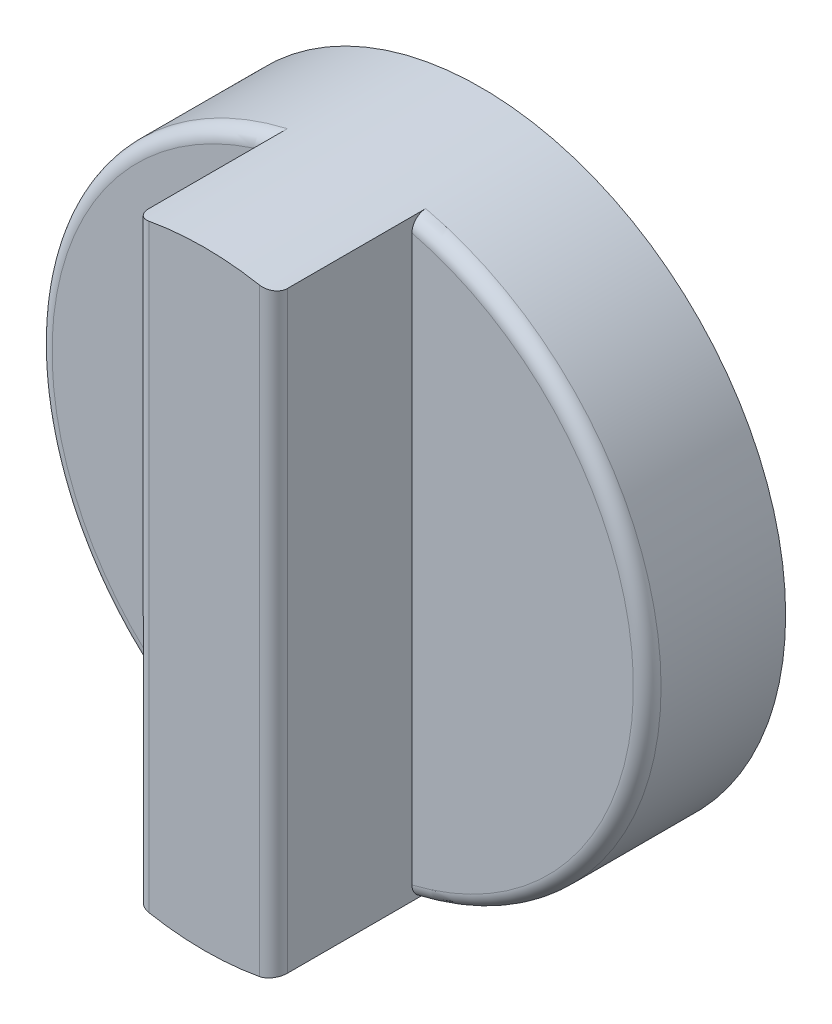
ISO-10303-21;
HEADER;
FILE_DESCRIPTION(('STEP AP214'),'2;1');
FILE_NAME('part.step','',(''),(''),'','','');
FILE_SCHEMA(('AUTOMOTIVE_DESIGN { 1 0 10303 214 1 1 1 1 }'));
ENDSEC;
DATA;
#1=APPLICATION_CONTEXT('core data for automotive mechanical design processes');
#2=APPLICATION_PROTOCOL_DEFINITION('international standard','automotive_design',2000,#1);
#3=PRODUCT_CONTEXT('',#1,'mechanical');
#4=PRODUCT('Part','Part','',(#3));
#5=PRODUCT_RELATED_PRODUCT_CATEGORY('part','',(#4));
#6=PRODUCT_DEFINITION_FORMATION('','',#4);
#7=PRODUCT_DEFINITION_CONTEXT('part definition',#1,'design');
#8=PRODUCT_DEFINITION('design','',#6,#7);
#9=PRODUCT_DEFINITION_SHAPE('','',#8);
#10=(LENGTH_UNIT() NAMED_UNIT(*) SI_UNIT(.MILLI.,.METRE.));
#11=(NAMED_UNIT(*) PLANE_ANGLE_UNIT() SI_UNIT($,.RADIAN.));
#12=(NAMED_UNIT(*) SI_UNIT($,.STERADIAN.) SOLID_ANGLE_UNIT());
#13=UNCERTAINTY_MEASURE_WITH_UNIT(LENGTH_MEASURE(1.E-05),#10,'distance_accuracy_value','');
#14=(GEOMETRIC_REPRESENTATION_CONTEXT(3) GLOBAL_UNCERTAINTY_ASSIGNED_CONTEXT((#13)) GLOBAL_UNIT_ASSIGNED_CONTEXT((#10,
#11,#12)) REPRESENTATION_CONTEXT('',''));
#15=CARTESIAN_POINT('',(0.,0.,0.));
#16=DIRECTION('',(0.,0.,1.));
#17=DIRECTION('',(1.,0.,0.));
#18=AXIS2_PLACEMENT_3D('',#15,#16,#17);
#19=CARTESIAN_POINT('',(0.,0.,5.));
#20=DIRECTION('',(0.,0.,1.));
#21=DIRECTION('',(1.,0.,0.));
#22=AXIS2_PLACEMENT_3D('',#19,#20,#21);
#23=PLANE('',#22);
#24=DIRECTION('',(0.,1.,0.));
#25=VECTOR('',#24,1.);
#26=CARTESIAN_POINT('',(2.5,10.7121426428143,5.));
#27=LINE('',#26,#25);
#28=CARTESIAN_POINT('',(2.5,-10.1980390271856,5.));
#29=VERTEX_POINT('',#28);
#30=CARTESIAN_POINT('',(2.5,10.1980390271856,5.));
#31=VERTEX_POINT('',#30);
#32=EDGE_CURVE('E104',#29,#31,#27,.T.);
#33=ORIENTED_EDGE('',*,*,#32,.F.);
#34=CARTESIAN_POINT('',(0.,0.,5.));
#35=DIRECTION('',(0.,0.,1.));
#36=DIRECTION('',(1.,0.,0.));
#37=AXIS2_PLACEMENT_3D('',#34,#35,#36);
#38=CIRCLE('',#37,10.5);
#39=EDGE_CURVE('E116',#29,#31,#38,.T.);
#40=ORIENTED_EDGE('',*,*,#39,.T.);
#41=EDGE_LOOP('',(#33,#40));
#42=FACE_BOUND('',#41,.T.);
#43=ADVANCED_FACE('F35',(#42),#23,.T.);
#44=CARTESIAN_POINT('',(0.,0.,5.));
#45=DIRECTION('',(0.,0.,-1.));
#46=DIRECTION('',(-1.,0.,0.));
#47=AXIS2_PLACEMENT_3D('',#44,#45,#46);
#48=CYLINDRICAL_SURFACE('',#47,11.);
#49=CARTESIAN_POINT('',(0.,0.,10.));
#50=DIRECTION('',(0.,0.,1.));
#51=DIRECTION('',(1.,0.,0.));
#52=AXIS2_PLACEMENT_3D('',#49,#50,#51);
#53=CIRCLE('',#52,11.);
#54=CARTESIAN_POINT('',(-2.,-10.816653826392,10.));
#55=VERTEX_POINT('',#54);
#56=CARTESIAN_POINT('',(2.,-10.816653826392,10.));
#57=VERTEX_POINT('',#56);
#58=EDGE_CURVE('E141',#55,#57,#53,.T.);
#59=ORIENTED_EDGE('',*,*,#58,.F.);
#60=CARTESIAN_POINT('',(-2.,-10.816653826392,10.));
#61=CARTESIAN_POINT('',(-2.02862153703975,-10.8113662095429,10.0000213404446));
#62=CARTESIAN_POINT('',(-2.05721254083428,-10.8059578710467,9.99754379930271));
#63=CARTESIAN_POINT('',(-2.11353414638347,-10.7950808099508,9.98777116275413));
#64=CARTESIAN_POINT('',(-2.14126514228026,-10.7896121166177,9.98047830941739));
#65=CARTESIAN_POINT('',(-2.19510777794717,-10.7787876827155,9.96125055821718));
#66=CARTESIAN_POINT('',(-2.22121867283804,-10.7734319948393,9.94931354316273));
#67=CARTESIAN_POINT('',(-2.27106004032942,-10.763035495613,9.92112408746325));
#68=CARTESIAN_POINT('',(-2.29479102447578,-10.7579946166851,9.90487257694091));
#69=CARTESIAN_POINT('',(-2.33909290710375,-10.748449062014,9.8685556184287));
#70=CARTESIAN_POINT('',(-2.35967602916607,-10.7439423283004,9.84850563700296));
#71=CARTESIAN_POINT('',(-2.39717034524882,-10.735638965817,9.80508717618582));
#72=CARTESIAN_POINT('',(-2.41408107707436,-10.7318424264382,9.78171827969821));
#73=CARTESIAN_POINT('',(-2.44340182098612,-10.7252044333049,9.73279445481042));
#74=CARTESIAN_POINT('',(-2.45589036222761,-10.7223463883734,9.7072887981401));
#75=CARTESIAN_POINT('',(-2.47638500310133,-10.7176316838528,9.65446062646807));
#76=CARTESIAN_POINT('',(-2.48439534795281,-10.7157740759356,9.62713985973531));
#77=CARTESIAN_POINT('',(-2.49334605269039,-10.7136938805199,9.58299677947831));
#78=CARTESIAN_POINT('',(-2.49583968714614,-10.7131129493531,9.56649046941556));
#79=CARTESIAN_POINT('',(-2.4991662292649,-10.7123372423391,9.53332549333509));
#80=CARTESIAN_POINT('',(-2.50000142608869,-10.7121419342141,9.51666706925534));
#81=CARTESIAN_POINT('',(-2.5,-10.7121426428143,9.5));
#82=B_SPLINE_CURVE_WITH_KNOTS('',3,(#60,#61,#62,#63,#64,#65,#66,#67,#68,#69,#70,#71,#72,#73,#74,
#75,#76,#77,#78,#79,#80,#81),.UNSPECIFIED.,.F.,.F.,(4,2,2,2,2,2,2,2,2,2,4),(0.,
0.0872010234356741,0.174361473582097,0.261561705280542,0.348743153520842,0.435576963814692,
0.52242169639899,0.607636162073093,0.692769708967522,0.742801114060534,0.792763412083773),.UNSPECIFIED.);
#83=CARTESIAN_POINT('',(-2.5,-10.7121426428143,9.5));
#84=VERTEX_POINT('',#83);
#85=EDGE_CURVE('E58',#55,#84,#82,.T.);
#86=ORIENTED_EDGE('',*,*,#85,.T.);
#87=DIRECTION('',(0.,0.,-1.));
#88=VECTOR('',#87,1.);
#89=CARTESIAN_POINT('',(-2.5,-10.7121426428143,10.));
#90=LINE('',#89,#88);
#91=CARTESIAN_POINT('',(-2.5,-10.7121426428143,4.5));
#92=VERTEX_POINT('',#91);
#93=EDGE_CURVE('E150',#84,#92,#90,.T.);
#94=ORIENTED_EDGE('',*,*,#93,.T.);
#95=CARTESIAN_POINT('',(0.,0.,4.5));
#96=DIRECTION('',(0.,0.,1.));
#97=DIRECTION('',(1.,0.,0.));
#98=AXIS2_PLACEMENT_3D('',#95,#96,#97);
#99=CIRCLE('',#98,11.);
#100=CARTESIAN_POINT('',(-2.5,10.7121426428143,4.5));
#101=VERTEX_POINT('',#100);
#102=EDGE_CURVE('E121',#92,#101,#99,.F.);
#103=ORIENTED_EDGE('',*,*,#102,.T.);
#104=DIRECTION('',(0.,0.,-1.));
#105=VECTOR('',#104,1.);
#106=CARTESIAN_POINT('',(-2.5,10.7121426428143,10.));
#107=LINE('',#106,#105);
#108=CARTESIAN_POINT('',(-2.5,10.7121426428143,9.5));
#109=VERTEX_POINT('',#108);
#110=EDGE_CURVE('E128',#109,#101,#107,.T.);
#111=ORIENTED_EDGE('',*,*,#110,.F.);
#112=CARTESIAN_POINT('',(-2.5,10.7121426428143,9.5));
#113=CARTESIAN_POINT('',(-2.50002609759204,10.7121335032181,9.5276290509069));
#114=CARTESIAN_POINT('',(-2.49771160311741,10.7126766709447,9.55524579742618));
#115=CARTESIAN_POINT('',(-2.48860022930894,10.7147985479106,9.60964505766043));
#116=CARTESIAN_POINT('',(-2.48181054648572,10.7163755945567,9.63642883856663));
#117=CARTESIAN_POINT('',(-2.46394484020121,10.7204969304435,9.68845075342602));
#118=CARTESIAN_POINT('',(-2.45286804914521,10.7230413928959,9.7136886096479));
#119=CARTESIAN_POINT('',(-2.4267824323611,10.7289750903094,9.76193206942072));
#120=CARTESIAN_POINT('',(-2.41177334400114,10.7323643816946,9.78493752373241));
#121=CARTESIAN_POINT('',(-2.37805439354746,10.7398863214923,9.82839131802693));
#122=CARTESIAN_POINT('',(-2.35930016826004,10.7440278211467,9.84880367618938));
#123=CARTESIAN_POINT('',(-2.31875130044111,10.7528518234924,9.88621074943502));
#124=CARTESIAN_POINT('',(-2.29695587400892,10.7575344656152,9.90320458059157));
#125=CARTESIAN_POINT('',(-2.25037838770471,10.7673755548841,9.93370977725558));
#126=CARTESIAN_POINT('',(-2.22553754821319,10.7725426794033,9.94712853819208));
#127=CARTESIAN_POINT('',(-2.17399271265052,10.7830629369205,9.96959146874091));
#128=CARTESIAN_POINT('',(-2.14728942357009,10.7884159989531,9.9786372881023));
#129=CARTESIAN_POINT('',(-2.1004097305479,10.7976237592761,9.99023146635226));
#130=CARTESIAN_POINT('',(-2.08050032907274,10.8014781427642,9.99389009037011));
#131=CARTESIAN_POINT('',(-2.04040019642943,10.8091252464543,9.99877453662183));
#132=CARTESIAN_POINT('',(-2.0202098511351,10.8129180382,10.0000034168439));
#133=CARTESIAN_POINT('',(-2.,10.816653826392,10.));
#134=B_SPLINE_CURVE_WITH_KNOTS('',3,(#112,#113,#114,#115,#116,#117,#118,#119,#120,#121,#122,
#123,#124,#125,#126,#127,#128,#129,#130,#131,#132,#133),.UNSPECIFIED.,.F.,.F.,(4,2,2,2,2,2,2,2,
2,2,4),(0.,0.0827664631847965,0.165400154020939,0.248048647037472,0.330702661422675,
0.414401009698746,0.498120972070913,0.583835340340382,0.669517346465313,0.731198303880241,
0.792801582318874),.UNSPECIFIED.);
#135=CARTESIAN_POINT('',(-2.,10.816653826392,10.));
#136=VERTEX_POINT('',#135);
#137=EDGE_CURVE('E181',#109,#136,#134,.T.);
#138=ORIENTED_EDGE('',*,*,#137,.T.);
#139=CARTESIAN_POINT('',(0.,0.,10.));
#140=DIRECTION('',(0.,0.,1.));
#141=DIRECTION('',(1.,0.,0.));
#142=AXIS2_PLACEMENT_3D('',#139,#140,#141);
#143=CIRCLE('',#142,11.);
#144=CARTESIAN_POINT('',(2.,10.816653826392,10.));
#145=VERTEX_POINT('',#144);
#146=EDGE_CURVE('E117',#145,#136,#143,.T.);
#147=ORIENTED_EDGE('',*,*,#146,.F.);
#148=CARTESIAN_POINT('',(2.,10.816653826392,10.));
#149=CARTESIAN_POINT('',(2.02862153703975,10.8113662095429,10.0000213404446));
#150=CARTESIAN_POINT('',(2.05721254083428,10.8059578710467,9.99754379930271));
#151=CARTESIAN_POINT('',(2.11353414638347,10.7950808099508,9.98777116275413));
#152=CARTESIAN_POINT('',(2.14126514228025,10.7896121166177,9.98047830941739));
#153=CARTESIAN_POINT('',(2.19510777794717,10.7787876827155,9.96125055821718));
#154=CARTESIAN_POINT('',(2.22121867283804,10.7734319948393,9.94931354316273));
#155=CARTESIAN_POINT('',(2.27106004032942,10.763035495613,9.92112408746325));
#156=CARTESIAN_POINT('',(2.29479102447578,10.7579946166851,9.90487257694091));
#157=CARTESIAN_POINT('',(2.33909290710374,10.748449062014,9.8685556184287));
#158=CARTESIAN_POINT('',(2.35967602916607,10.7439423283004,9.84850563700295));
#159=CARTESIAN_POINT('',(2.39717034524882,10.735638965817,9.80508717618581));
#160=CARTESIAN_POINT('',(2.41408107707436,10.7318424264382,9.78171827969821));
#161=CARTESIAN_POINT('',(2.44340182098612,10.7252044333049,9.73279445481042));
#162=CARTESIAN_POINT('',(2.45589036222761,10.7223463883734,9.7072887981401));
#163=CARTESIAN_POINT('',(2.47638500310133,10.7176316838528,9.65446062646807));
#164=CARTESIAN_POINT('',(2.48439534795281,10.7157740759356,9.6271398597353));
#165=CARTESIAN_POINT('',(2.49334605269039,10.7136938805199,9.58299677947831));
#166=CARTESIAN_POINT('',(2.49583968714614,10.7131129493531,9.56649046941556));
#167=CARTESIAN_POINT('',(2.4991662292649,10.7123372423391,9.53332549333509));
#168=CARTESIAN_POINT('',(2.50000142608869,10.7121419342141,9.51666706925534));
#169=CARTESIAN_POINT('',(2.5,10.7121426428143,9.5));
#170=B_SPLINE_CURVE_WITH_KNOTS('',3,(#148,#149,#150,#151,#152,#153,#154,#155,#156,#157,#158,
#159,#160,#161,#162,#163,#164,#165,#166,#167,#168,#169),.UNSPECIFIED.,.F.,.F.,(4,2,2,2,2,2,2,2,
2,2,4),(0.,0.0872010234356741,0.174361473582097,0.261561705280542,0.348743153520842,
0.435576963814694,0.52242169639899,0.607636162073093,0.692769708967523,0.742801114060533,
0.792763412083773),.UNSPECIFIED.);
#171=CARTESIAN_POINT('',(2.5,10.7121426428143,9.5));
#172=VERTEX_POINT('',#171);
#173=EDGE_CURVE('E161',#145,#172,#170,.T.);
#174=ORIENTED_EDGE('',*,*,#173,.T.);
#175=DIRECTION('',(0.,0.,-1.));
#176=VECTOR('',#175,1.);
#177=CARTESIAN_POINT('',(2.5,10.7121426428143,10.));
#178=LINE('',#177,#176);
#179=CARTESIAN_POINT('',(2.5,10.7121426428143,4.5));
#180=VERTEX_POINT('',#179);
#181=EDGE_CURVE('E290',#172,#180,#178,.T.);
#182=ORIENTED_EDGE('',*,*,#181,.T.);
#183=CARTESIAN_POINT('',(0.,0.,4.5));
#184=DIRECTION('',(0.,0.,1.));
#185=DIRECTION('',(1.,0.,0.));
#186=AXIS2_PLACEMENT_3D('',#183,#184,#185);
#187=CIRCLE('',#186,11.);
#188=CARTESIAN_POINT('',(2.5,-10.7121426428143,4.5));
#189=VERTEX_POINT('',#188);
#190=EDGE_CURVE('E125',#180,#189,#187,.F.);
#191=ORIENTED_EDGE('',*,*,#190,.T.);
#192=DIRECTION('',(0.,0.,-1.));
#193=VECTOR('',#192,1.);
#194=CARTESIAN_POINT('',(2.5,-10.7121426428143,10.));
#195=LINE('',#194,#193);
#196=CARTESIAN_POINT('',(2.5,-10.7121426428143,9.5));
#197=VERTEX_POINT('',#196);
#198=EDGE_CURVE('E106',#197,#189,#195,.T.);
#199=ORIENTED_EDGE('',*,*,#198,.F.);
#200=CARTESIAN_POINT('',(2.5,-10.7121426428143,9.5));
#201=CARTESIAN_POINT('',(2.50002609759204,-10.7121335032181,9.5276290509069));
#202=CARTESIAN_POINT('',(2.49771160311741,-10.7126766709447,9.55524579742618));
#203=CARTESIAN_POINT('',(2.48860022930894,-10.7147985479106,9.60964505766043));
#204=CARTESIAN_POINT('',(2.48181054648572,-10.7163755945567,9.63642883856663));
#205=CARTESIAN_POINT('',(2.46394484020121,-10.7204969304435,9.68845075342602));
#206=CARTESIAN_POINT('',(2.45286804914521,-10.7230413928959,9.71368860964789));
#207=CARTESIAN_POINT('',(2.42678243236111,-10.7289750903094,9.76193206942072));
#208=CARTESIAN_POINT('',(2.41177334400114,-10.7323643816946,9.78493752373241));
#209=CARTESIAN_POINT('',(2.37805439354746,-10.7398863214923,9.82839131802693));
#210=CARTESIAN_POINT('',(2.35930016826004,-10.7440278211467,9.84880367618938));
#211=CARTESIAN_POINT('',(2.31875130044112,-10.7528518234924,9.88621074943502));
#212=CARTESIAN_POINT('',(2.29695587400892,-10.7575344656152,9.90320458059157));
#213=CARTESIAN_POINT('',(2.25037838770471,-10.7673755548841,9.93370977725558));
#214=CARTESIAN_POINT('',(2.22553754821319,-10.7725426794032,9.94712853819208));
#215=CARTESIAN_POINT('',(2.17399271265052,-10.7830629369205,9.96959146874091));
#216=CARTESIAN_POINT('',(2.1472894235701,-10.7884159989531,9.9786372881023));
#217=CARTESIAN_POINT('',(2.1004097305479,-10.7976237592761,9.99023146635226));
#218=CARTESIAN_POINT('',(2.08050032907274,-10.8014781427642,9.99389009037011));
#219=CARTESIAN_POINT('',(2.04040019642943,-10.8091252464543,9.99877453662183));
#220=CARTESIAN_POINT('',(2.0202098511351,-10.8129180382,10.0000034168439));
#221=CARTESIAN_POINT('',(2.,-10.816653826392,10.));
#222=B_SPLINE_CURVE_WITH_KNOTS('',3,(#200,#201,#202,#203,#204,#205,#206,#207,#208,#209,#210,
#211,#212,#213,#214,#215,#216,#217,#218,#219,#220,#221),.UNSPECIFIED.,.F.,.F.,(4,2,2,2,2,2,2,2,
2,2,4),(0.,0.0827664631847965,0.165400154020939,0.248048647037469,0.330702661422675,
0.414401009698746,0.498120972070914,0.583835340340382,0.669517346465312,0.731198303880241,
0.792801582318875),.UNSPECIFIED.);
#223=EDGE_CURVE('E155',#197,#57,#222,.T.);
#224=ORIENTED_EDGE('',*,*,#223,.T.);
#225=EDGE_LOOP('',(#59,#86,#94,#103,#111,#138,#147,#174,#182,#191,#199,#224));
#226=FACE_BOUND('',#225,.T.);
#227=CARTESIAN_POINT('',(0.,0.,0.));
#228=DIRECTION('',(0.,0.,1.));
#229=DIRECTION('',(1.,0.,0.));
#230=AXIS2_PLACEMENT_3D('',#227,#228,#229);
#231=CIRCLE('',#230,11.);
#232=CARTESIAN_POINT('',(11.,0.,0.));
#233=VERTEX_POINT('',#232);
#234=EDGE_CURVE('E122',#233,#233,#231,.T.);
#235=ORIENTED_EDGE('',*,*,#234,.T.);
#236=EDGE_LOOP('',(#235));
#237=FACE_BOUND('',#236,.T.);
#238=ADVANCED_FACE('F167',(#226,#237),#48,.T.);
#239=DIRECTION('',(0.,-1.,0.));
#240=VECTOR('',#239,1.);
#241=CARTESIAN_POINT('',(-2.5,10.7121426428143,5.));
#242=LINE('',#241,#240);
#243=CARTESIAN_POINT('',(-2.5,10.1980390271856,5.));
#244=VERTEX_POINT('',#243);
#245=CARTESIAN_POINT('',(-2.5,-10.1980390271856,5.));
#246=VERTEX_POINT('',#245);
#247=EDGE_CURVE('E118',#244,#246,#242,.T.);
#248=ORIENTED_EDGE('',*,*,#247,.F.);
#249=CARTESIAN_POINT('',(0.,0.,5.));
#250=DIRECTION('',(0.,0.,1.));
#251=DIRECTION('',(1.,0.,0.));
#252=AXIS2_PLACEMENT_3D('',#249,#250,#251);
#253=CIRCLE('',#252,10.5);
#254=EDGE_CURVE('E134',#244,#246,#253,.T.);
#255=ORIENTED_EDGE('',*,*,#254,.T.);
#256=EDGE_LOOP('',(#248,#255));
#257=FACE_BOUND('',#256,.T.);
#258=ADVANCED_FACE('F172',(#257),#23,.T.);
#259=CARTESIAN_POINT('',(0.,0.,0.));
#260=DIRECTION('',(0.,0.,1.));
#261=DIRECTION('',(1.,0.,0.));
#262=AXIS2_PLACEMENT_3D('',#259,#260,#261);
#263=PLANE('',#262);
#264=ORIENTED_EDGE('',*,*,#234,.F.);
#265=EDGE_LOOP('',(#264));
#266=FACE_BOUND('',#265,.T.);
#267=ADVANCED_FACE('F173',(#266),#263,.F.);
#268=CARTESIAN_POINT('',(-2.5,10.7121426428143,10.));
#269=DIRECTION('',(1.,0.,0.));
#270=DIRECTION('',(0.,0.,-1.));
#271=AXIS2_PLACEMENT_3D('',#268,#269,#270);
#272=PLANE('',#271);
#273=ORIENTED_EDGE('',*,*,#93,.F.);
#274=DIRECTION('',(0.,-1.,0.));
#275=VECTOR('',#274,1.);
#276=CARTESIAN_POINT('',(-2.5,10.7121426428143,9.5));
#277=LINE('',#276,#275);
#278=EDGE_CURVE('E44',#84,#109,#277,.F.);
#279=ORIENTED_EDGE('',*,*,#278,.T.);
#280=ORIENTED_EDGE('',*,*,#110,.T.);
#281=CARTESIAN_POINT('',(-2.5,10.7121426428143,4.5));
#282=CARTESIAN_POINT('',(-2.5,10.7121694346541,4.52758992138319));
#283=CARTESIAN_POINT('',(-2.5,10.7097993944003,4.55516854979914));
#284=CARTESIAN_POINT('',(-2.5,10.7004683092707,4.60949699243114));
#285=CARTESIAN_POINT('',(-2.5,10.6935141614661,4.63624798866541));
#286=CARTESIAN_POINT('',(-2.5,10.6752142718632,4.68820845229148));
#287=CARTESIAN_POINT('',(-2.5,10.6638675005562,4.71341755670169));
#288=CARTESIAN_POINT('',(-2.5,10.6371498098026,4.76160106829796));
#289=CARTESIAN_POINT('',(-2.5,10.6217787937513,4.78457542181919));
#290=CARTESIAN_POINT('',(-2.5,10.5872887838066,4.82792645818738));
#291=CARTESIAN_POINT('',(-2.5,10.5681304868222,4.8482718456929));
#292=CARTESIAN_POINT('',(-2.5,10.5267415083972,4.88555519537869));
#293=CARTESIAN_POINT('',(-2.5,10.5045101373807,4.90249239068426));
#294=CARTESIAN_POINT('',(-2.5,10.4570189097693,4.93292911798651));
#295=CARTESIAN_POINT('',(-2.5,10.4316971893962,4.94633201925046));
#296=CARTESIAN_POINT('',(-2.5,10.3792041116311,4.96881441687147));
#297=CARTESIAN_POINT('',(-2.5,10.35203308624,4.97789468693155));
#298=CARTESIAN_POINT('',(-2.5,10.3036636222839,4.9897951393075));
#299=CARTESIAN_POINT('',(-2.5,10.282706119119,4.99362060845209));
#300=CARTESIAN_POINT('',(-2.5,10.2405140598887,4.99872303719405));
#301=CARTESIAN_POINT('',(-2.5,10.219279951818,5.00000370064122));
#302=CARTESIAN_POINT('',(-2.5,10.1980390271856,5.));
#303=B_SPLINE_CURVE_WITH_KNOTS('',3,(#281,#282,#283,#284,#285,#286,#287,#288,#289,#290,#291,
#292,#293,#294,#295,#296,#297,#298,#299,#300,#301,#302),.UNSPECIFIED.,.F.,.F.,(4,2,2,2,2,2,2,2,
2,2,4),(0.,0.0826511810424042,0.165178291275517,0.247724755286896,0.330273201062005,
0.413728111798264,0.49720177971363,0.582764303693524,0.668311507167213,0.732075144100183,
0.795745907763697),.UNSPECIFIED.);
#304=EDGE_CURVE('E204',#101,#244,#303,.T.);
#305=ORIENTED_EDGE('',*,*,#304,.T.);
#306=ORIENTED_EDGE('',*,*,#247,.T.);
#307=CARTESIAN_POINT('',(-2.5,-10.1980390271856,5.));
#308=CARTESIAN_POINT('',(-2.5,-10.2275838304305,5.0000212973716));
#309=CARTESIAN_POINT('',(-2.5,-10.2571275456777,4.99753085844665));
#310=CARTESIAN_POINT('',(-2.5,-10.3153927821899,4.98766895949828));
#311=CARTESIAN_POINT('',(-2.5,-10.344114197341,4.98029687245715));
#312=CARTESIAN_POINT('',(-2.5,-10.3999298717334,4.96080614054429));
#313=CARTESIAN_POINT('',(-2.5,-10.4270227656521,4.94868357525165));
#314=CARTESIAN_POINT('',(-2.5,-10.4787363815173,4.92000070997253));
#315=CARTESIAN_POINT('',(-2.5,-10.5033582004709,4.90344239127782));
#316=CARTESIAN_POINT('',(-2.5,-10.5490297719978,4.86659417860872));
#317=CARTESIAN_POINT('',(-2.5,-10.5701271463144,4.84636335926054));
#318=CARTESIAN_POINT('',(-2.5,-10.6085172014929,4.80255409463613));
#319=CARTESIAN_POINT('',(-2.5,-10.6258093681436,4.77897519762977));
#320=CARTESIAN_POINT('',(-2.5,-10.6556006370727,4.72982033661094));
#321=CARTESIAN_POINT('',(-2.5,-10.6682147667658,4.7043139827247));
#322=CARTESIAN_POINT('',(-2.5,-10.688855490193,4.65151988064985));
#323=CARTESIAN_POINT('',(-2.5,-10.6968865746416,4.62423390555132));
#324=CARTESIAN_POINT('',(-2.5,-10.7057013407365,4.58059923779771));
#325=CARTESIAN_POINT('',(-2.5,-10.7081156025596,4.56456305213208));
#326=CARTESIAN_POINT('',(-2.5,-10.7113356297193,4.53235386187799));
#327=CARTESIAN_POINT('',(-2.5,-10.7121437544082,4.51618109307509));
#328=CARTESIAN_POINT('',(-2.5,-10.7121426428149,4.50000000000013));
#329=B_SPLINE_CURVE_WITH_KNOTS('',3,(#307,#308,#309,#310,#311,#312,#313,#314,#315,#316,#317,
#318,#319,#320,#321,#322,#323,#324,#325,#326,#327,#328),.UNSPECIFIED.,.F.,.F.,(4,2,2,2,2,2,2,2,
2,2,4),(0.,0.0885290657043179,0.177069504629475,0.265683167611781,0.354257315857976,
0.441515943978519,0.528786356435154,0.613740621212553,0.698611499658554,0.747189719969765,
0.795696527882252),.UNSPECIFIED.);
#330=EDGE_CURVE('E111',#246,#92,#329,.T.);
#331=ORIENTED_EDGE('',*,*,#330,.T.);
#332=EDGE_LOOP('',(#273,#279,#280,#305,#306,#331));
#333=FACE_BOUND('',#332,.T.);
#334=ADVANCED_FACE('F211',(#333),#272,.F.);
#335=CARTESIAN_POINT('',(2.5,10.7121426428143,10.));
#336=DIRECTION('',(-1.,0.,0.));
#337=DIRECTION('',(0.,-1.,0.));
#338=AXIS2_PLACEMENT_3D('',#335,#336,#337);
#339=PLANE('',#338);
#340=ORIENTED_EDGE('',*,*,#181,.F.);
#341=DIRECTION('',(0.,1.,0.));
#342=VECTOR('',#341,1.);
#343=CARTESIAN_POINT('',(2.5,-10.7121426428143,9.5));
#344=LINE('',#343,#342);
#345=EDGE_CURVE('E11',#172,#197,#344,.F.);
#346=ORIENTED_EDGE('',*,*,#345,.T.);
#347=ORIENTED_EDGE('',*,*,#198,.T.);
#348=CARTESIAN_POINT('',(2.5,-10.7121426428143,4.5));
#349=CARTESIAN_POINT('',(2.5,-10.7121694346541,4.52758992138319));
#350=CARTESIAN_POINT('',(2.5,-10.7097993944003,4.55516854979914));
#351=CARTESIAN_POINT('',(2.5,-10.7004683092707,4.60949699243114));
#352=CARTESIAN_POINT('',(2.5,-10.6935141614661,4.63624798866541));
#353=CARTESIAN_POINT('',(2.5,-10.6752142718632,4.68820845229148));
#354=CARTESIAN_POINT('',(2.5,-10.6638675005562,4.71341755670169));
#355=CARTESIAN_POINT('',(2.5,-10.6371498098026,4.76160106829796));
#356=CARTESIAN_POINT('',(2.5,-10.6217787937513,4.78457542181919));
#357=CARTESIAN_POINT('',(2.5,-10.5872887838066,4.82792645818738));
#358=CARTESIAN_POINT('',(2.5,-10.5681304868222,4.8482718456929));
#359=CARTESIAN_POINT('',(2.5,-10.5267415083972,4.88555519537869));
#360=CARTESIAN_POINT('',(2.5,-10.5045101373807,4.90249239068425));
#361=CARTESIAN_POINT('',(2.5,-10.4570189097693,4.93292911798651));
#362=CARTESIAN_POINT('',(2.5,-10.4316971893962,4.94633201925046));
#363=CARTESIAN_POINT('',(2.5,-10.3792041116311,4.96881441687147));
#364=CARTESIAN_POINT('',(2.5,-10.35203308624,4.97789468693155));
#365=CARTESIAN_POINT('',(2.5,-10.3036636222839,4.98979513930749));
#366=CARTESIAN_POINT('',(2.5,-10.282706119119,4.99362060845209));
#367=CARTESIAN_POINT('',(2.5,-10.2405140598887,4.99872303719405));
#368=CARTESIAN_POINT('',(2.5,-10.219279951818,5.00000370064122));
#369=CARTESIAN_POINT('',(2.5,-10.1980390271856,5.));
#370=B_SPLINE_CURVE_WITH_KNOTS('',3,(#348,#349,#350,#351,#352,#353,#354,#355,#356,#357,#358,
#359,#360,#361,#362,#363,#364,#365,#366,#367,#368,#369),.UNSPECIFIED.,.F.,.F.,(4,2,2,2,2,2,2,2,
2,2,4),(0.,0.0826511810424041,0.165178291275515,0.247724755286894,0.330273201062005,
0.413728111798265,0.497201779713627,0.58276430369352,0.668311507167208,0.732075144100182,
0.795745907763696),.UNSPECIFIED.);
#371=EDGE_CURVE('E99',#189,#29,#370,.T.);
#372=ORIENTED_EDGE('',*,*,#371,.T.);
#373=ORIENTED_EDGE('',*,*,#32,.T.);
#374=CARTESIAN_POINT('',(2.5,10.1980390271856,5.));
#375=CARTESIAN_POINT('',(2.5,10.2275838304305,5.0000212973716));
#376=CARTESIAN_POINT('',(2.5,10.2571275456777,4.99753085844665));
#377=CARTESIAN_POINT('',(2.5,10.3153927821899,4.98766895949828));
#378=CARTESIAN_POINT('',(2.5,10.344114197341,4.98029687245715));
#379=CARTESIAN_POINT('',(2.5,10.3999298717334,4.96080614054429));
#380=CARTESIAN_POINT('',(2.5,10.4270227656521,4.94868357525165));
#381=CARTESIAN_POINT('',(2.5,10.4787363815173,4.92000070997253));
#382=CARTESIAN_POINT('',(2.5,10.5033582004709,4.90344239127782));
#383=CARTESIAN_POINT('',(2.5,10.5490297719978,4.86659417860872));
#384=CARTESIAN_POINT('',(2.5,10.5701271463144,4.84636335926054));
#385=CARTESIAN_POINT('',(2.5,10.6085172014929,4.80255409463613));
#386=CARTESIAN_POINT('',(2.5,10.6258093681436,4.77897519762977));
#387=CARTESIAN_POINT('',(2.5,10.6556006370727,4.72982033661094));
#388=CARTESIAN_POINT('',(2.5,10.6682147667658,4.7043139827247));
#389=CARTESIAN_POINT('',(2.5,10.688855490193,4.65151988064985));
#390=CARTESIAN_POINT('',(2.5,10.6968865746416,4.62423390555132));
#391=CARTESIAN_POINT('',(2.5,10.7057013407365,4.58059923779771));
#392=CARTESIAN_POINT('',(2.5,10.7081156025596,4.56456305213208));
#393=CARTESIAN_POINT('',(2.5,10.7113356297193,4.53235386187799));
#394=CARTESIAN_POINT('',(2.5,10.7121437544082,4.51618109307509));
#395=CARTESIAN_POINT('',(2.5,10.7121426428149,4.50000000000013));
#396=B_SPLINE_CURVE_WITH_KNOTS('',3,(#374,#375,#376,#377,#378,#379,#380,#381,#382,#383,#384,
#385,#386,#387,#388,#389,#390,#391,#392,#393,#394,#395),.UNSPECIFIED.,.F.,.F.,(4,2,2,2,2,2,2,2,
2,2,4),(0.,0.0885290657043179,0.177069504629475,0.265683167611781,0.354257315857976,
0.441515943978519,0.528786356435154,0.613740621212553,0.698611499658554,0.747189719969765,
0.795696527882252),.UNSPECIFIED.);
#397=EDGE_CURVE('E112',#31,#180,#396,.T.);
#398=ORIENTED_EDGE('',*,*,#397,.T.);
#399=EDGE_LOOP('',(#340,#346,#347,#372,#373,#398));
#400=FACE_BOUND('',#399,.T.);
#401=ADVANCED_FACE('F102',(#400),#339,.F.);
#402=CARTESIAN_POINT('',(0.,0.,10.));
#403=DIRECTION('',(0.,0.,1.));
#404=DIRECTION('',(1.,0.,0.));
#405=AXIS2_PLACEMENT_3D('',#402,#403,#404);
#406=PLANE('',#405);
#407=ORIENTED_EDGE('',*,*,#146,.T.);
#408=DIRECTION('',(0.,-1.,0.));
#409=VECTOR('',#408,1.);
#410=CARTESIAN_POINT('',(-2.,-10.7121426428143,10.));
#411=LINE('',#410,#409);
#412=EDGE_CURVE('E162',#136,#55,#411,.T.);
#413=ORIENTED_EDGE('',*,*,#412,.T.);
#414=ORIENTED_EDGE('',*,*,#58,.T.);
#415=DIRECTION('',(0.,1.,0.));
#416=VECTOR('',#415,1.);
#417=CARTESIAN_POINT('',(2.,10.7121426428143,10.));
#418=LINE('',#417,#416);
#419=EDGE_CURVE('E209',#57,#145,#418,.T.);
#420=ORIENTED_EDGE('',*,*,#419,.T.);
#421=EDGE_LOOP('',(#407,#413,#414,#420));
#422=FACE_BOUND('',#421,.T.);
#423=ADVANCED_FACE('F253',(#422),#406,.T.);
#424=CARTESIAN_POINT('',(0.,0.,4.5));
#425=DIRECTION('',(0.,0.,1.));
#426=DIRECTION('',(1.,0.,0.));
#427=AXIS2_PLACEMENT_3D('',#424,#425,#426);
#428=TOROIDAL_SURFACE('',#427,10.5,0.5);
#429=ORIENTED_EDGE('',*,*,#371,.F.);
#430=ORIENTED_EDGE('',*,*,#190,.F.);
#431=ORIENTED_EDGE('',*,*,#397,.F.);
#432=ORIENTED_EDGE('',*,*,#39,.F.);
#433=EDGE_LOOP('',(#429,#430,#431,#432));
#434=FACE_BOUND('',#433,.T.);
#435=ADVANCED_FACE('F120',(#434),#428,.T.);
#436=CARTESIAN_POINT('',(0.,0.,4.5));
#437=DIRECTION('',(0.,0.,1.));
#438=DIRECTION('',(1.,0.,0.));
#439=AXIS2_PLACEMENT_3D('',#436,#437,#438);
#440=TOROIDAL_SURFACE('',#439,10.5,0.5);
#441=ORIENTED_EDGE('',*,*,#304,.F.);
#442=ORIENTED_EDGE('',*,*,#102,.F.);
#443=ORIENTED_EDGE('',*,*,#330,.F.);
#444=ORIENTED_EDGE('',*,*,#254,.F.);
#445=EDGE_LOOP('',(#441,#442,#443,#444));
#446=FACE_BOUND('',#445,.T.);
#447=ADVANCED_FACE('F191',(#446),#440,.T.);
#448=CARTESIAN_POINT('',(-2.,0.,9.5));
#449=DIRECTION('',(0.,1.,0.));
#450=DIRECTION('',(0.,0.,1.));
#451=AXIS2_PLACEMENT_3D('',#448,#449,#450);
#452=CYLINDRICAL_SURFACE('',#451,0.5);
#453=ORIENTED_EDGE('',*,*,#137,.F.);
#454=ORIENTED_EDGE('',*,*,#278,.F.);
#455=ORIENTED_EDGE('',*,*,#85,.F.);
#456=ORIENTED_EDGE('',*,*,#412,.F.);
#457=EDGE_LOOP('',(#453,#454,#455,#456));
#458=FACE_BOUND('',#457,.T.);
#459=ADVANCED_FACE('F188',(#458),#452,.T.);
#460=CARTESIAN_POINT('',(2.,0.,9.5));
#461=DIRECTION('',(0.,-1.,0.));
#462=DIRECTION('',(1.,0.,0.));
#463=AXIS2_PLACEMENT_3D('',#460,#461,#462);
#464=CYLINDRICAL_SURFACE('',#463,0.5);
#465=ORIENTED_EDGE('',*,*,#223,.F.);
#466=ORIENTED_EDGE('',*,*,#345,.F.);
#467=ORIENTED_EDGE('',*,*,#173,.F.);
#468=ORIENTED_EDGE('',*,*,#419,.F.);
#469=EDGE_LOOP('',(#465,#466,#467,#468));
#470=FACE_BOUND('',#469,.T.);
#471=ADVANCED_FACE('F37',(#470),#464,.T.);
#472=CLOSED_SHELL('',(#43,#238,#258,#267,#334,#401,#423,#435,#447,#459,#471));
#473=MANIFOLD_SOLID_BREP('B2',#472);
#474=ADVANCED_BREP_SHAPE_REPRESENTATION('',(#18,#473),#14);
#475=SHAPE_DEFINITION_REPRESENTATION(#9,#474);
ENDSEC;
END-ISO-10303-21;
